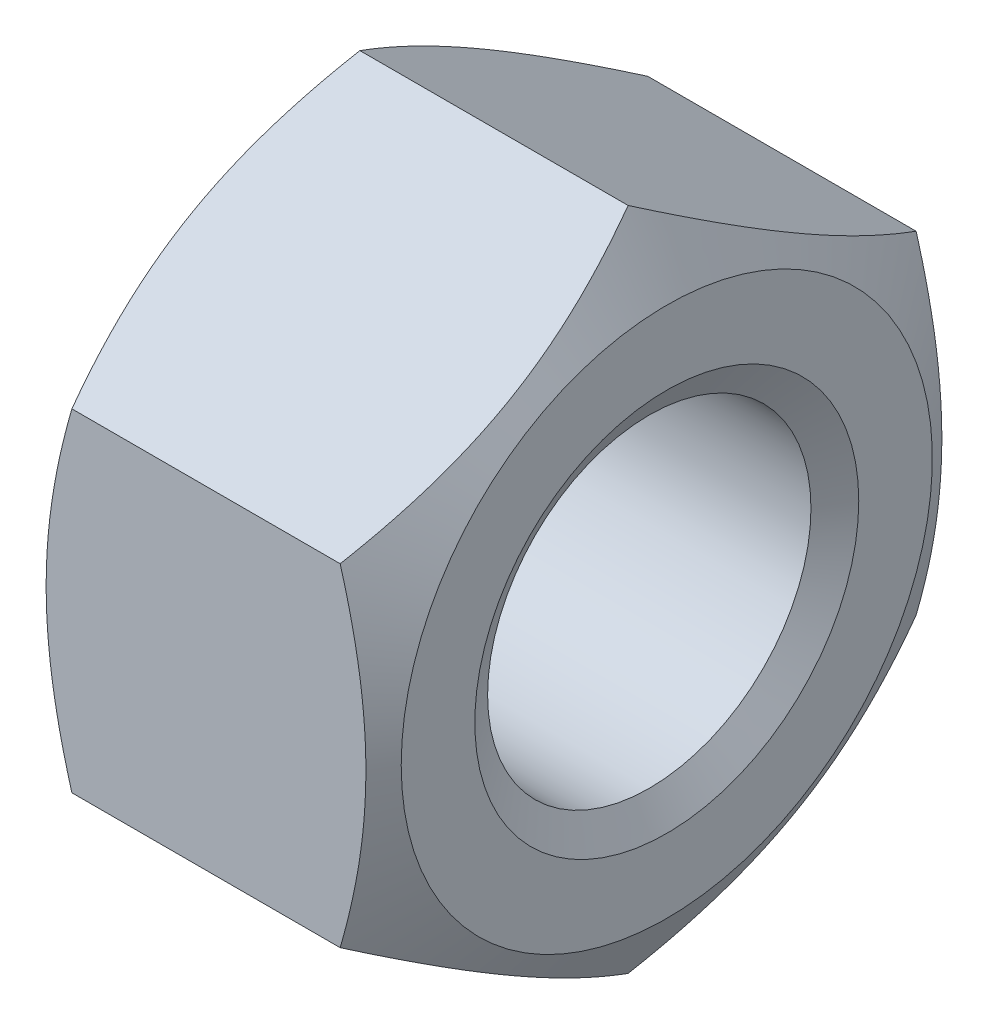
ISO-10303-21;
HEADER;
FILE_DESCRIPTION(('STEP AP214'),'2;1');
FILE_NAME('part.step','',(''),(''),'','','');
FILE_SCHEMA(('AUTOMOTIVE_DESIGN { 1 0 10303 214 1 1 1 1 }'));
ENDSEC;
DATA;
#1=APPLICATION_CONTEXT('core data for automotive mechanical design processes');
#2=APPLICATION_PROTOCOL_DEFINITION('international standard','automotive_design',2000,#1);
#3=PRODUCT_CONTEXT('',#1,'mechanical');
#4=PRODUCT('Part','Part','',(#3));
#5=PRODUCT_RELATED_PRODUCT_CATEGORY('part','',(#4));
#6=PRODUCT_DEFINITION_FORMATION('','',#4);
#7=PRODUCT_DEFINITION_CONTEXT('part definition',#1,'design');
#8=PRODUCT_DEFINITION('design','',#6,#7);
#9=PRODUCT_DEFINITION_SHAPE('','',#8);
#10=(LENGTH_UNIT() NAMED_UNIT(*) SI_UNIT(.MILLI.,.METRE.));
#11=(NAMED_UNIT(*) PLANE_ANGLE_UNIT() SI_UNIT($,.RADIAN.));
#12=(NAMED_UNIT(*) SI_UNIT($,.STERADIAN.) SOLID_ANGLE_UNIT());
#13=UNCERTAINTY_MEASURE_WITH_UNIT(LENGTH_MEASURE(1.E-05),#10,'distance_accuracy_value','');
#14=(GEOMETRIC_REPRESENTATION_CONTEXT(3) GLOBAL_UNCERTAINTY_ASSIGNED_CONTEXT((#13)) GLOBAL_UNIT_ASSIGNED_CONTEXT((#10,
#11,#12)) REPRESENTATION_CONTEXT('',''));
#15=CARTESIAN_POINT('',(0.,0.,0.));
#16=DIRECTION('',(0.,0.,1.));
#17=DIRECTION('',(1.,0.,0.));
#18=AXIS2_PLACEMENT_3D('',#15,#16,#17);
#19=CARTESIAN_POINT('',(0.,-5.19615242270663,9.));
#20=DIRECTION('',(0.,0.,1.));
#21=DIRECTION('',(1.,0.,0.));
#22=AXIS2_PLACEMENT_3D('',#19,#20,#21);
#23=PLANE('',#22);
#24=CARTESIAN_POINT('',(9.59200720064007,5.19615244908415,8.99999996280712));
#25=CARTESIAN_POINT('',(9.65793670212001,4.96774649350231,8.99999998663965));
#26=CARTESIAN_POINT('',(9.72087447602505,4.73844967700903,8.99999999641912));
#27=CARTESIAN_POINT('',(9.83994111979633,4.27799396747926,9.00000000358241));
#28=CARTESIAN_POINT('',(9.89606705063499,4.04683431625319,9.00000000096088));
#29=CARTESIAN_POINT('',(10.0007491843029,3.5822240750426,8.99999999903685));
#30=CARTESIAN_POINT('',(10.0492872997135,3.34876937968418,8.99999999974216));
#31=CARTESIAN_POINT('',(10.1377433441188,2.88027225541366,9.00000000025778));
#32=CARTESIAN_POINT('',(10.177663034133,2.64523016099952,9.00000000006827));
#33=CARTESIAN_POINT('',(10.2471978692114,2.17951731166429,8.9999999999334));
#34=CARTESIAN_POINT('',(10.2770419920113,1.94888095311432,8.99999999998215));
#35=CARTESIAN_POINT('',(10.3270801162312,1.48657638278632,9.00000000001784));
#36=CARTESIAN_POINT('',(10.3472749702591,1.25490826400092,9.00000000000477));
#37=CARTESIAN_POINT('',(10.3775101246047,0.791170290793493,8.99999999999523));
#38=CARTESIAN_POINT('',(10.3875619477008,0.55910119292837,8.99999999999872));
#39=CARTESIAN_POINT('',(10.3972935688812,0.0947495491302438,9.00000000000127));
#40=CARTESIAN_POINT('',(10.3969736875073,-0.137532989984409,9.00000000000031));
#41=CARTESIAN_POINT('',(10.3866846794573,-0.57177716286161,8.99999999999972));
#42=CARTESIAN_POINT('',(10.377970648293,-0.773769446120306,8.99999999999992));
#43=CARTESIAN_POINT('',(10.3528689081992,-1.17728085842499,9.00000000000007));
#44=CARTESIAN_POINT('',(10.33648068214,-1.37879995466515,9.00000000000002));
#45=CARTESIAN_POINT('',(10.2761920643438,-1.9825770521475,8.99999999999994));
#46=CARTESIAN_POINT('',(10.2211752626681,-2.38376637535483,8.99999999999998));
#47=CARTESIAN_POINT('',(10.0836351513658,-3.19040010074285,9.00000000000001));
#48=CARTESIAN_POINT('',(10.0005289331521,-3.59574157940424,9.00000000000001));
#49=CARTESIAN_POINT('',(9.81191325059322,-4.4003805552348,8.99999999999999));
#50=CARTESIAN_POINT('',(9.7064480744572,-4.7996883529283,8.99999999999998));
#51=CARTESIAN_POINT('',(9.59200725772001,-5.196152335705,9.));
#52=B_SPLINE_CURVE_WITH_KNOTS('',3,(#24,#25,#26,#27,#28,#29,#30,#31,#32,#33,#34,#35,#36,#37,#38,
#39,#40,#41,#42,#43,#44,#45,#46,#47,#48,#49,#50,#51),.UNSPECIFIED.,.F.,.F.,(4,2,2,2,2,2,2,2,2,2,
2,2,2,4),(0.,0.713211353556814,1.42672934244282,2.14192306043983,2.85697050292061,
3.55445831583942,4.25188448743001,4.94851746757711,5.64512891802145,6.25151818008083,
6.85794830989781,8.07167213792096,9.31231054455697,10.5505141021014),.UNSPECIFIED.);
#53=CARTESIAN_POINT('',(9.5920072451695,5.19615244446933,8.9999999623059));
#54=VERTEX_POINT('',#53);
#55=CARTESIAN_POINT('',(9.5920072451695,-5.19615237918125,8.99999999999999));
#56=VERTEX_POINT('',#55);
#57=EDGE_CURVE('E93',#54,#56,#52,.T.);
#58=ORIENTED_EDGE('',*,*,#57,.F.);
#59=DIRECTION('',(1.,0.,0.));
#60=VECTOR('',#59,1.);
#61=CARTESIAN_POINT('',(0.,5.19615242270663,8.99999999999999));
#62=LINE('',#61,#60);
#63=CARTESIAN_POINT('',(1.2079927548305,5.19615237918125,8.99999999999999));
#64=VERTEX_POINT('',#63);
#65=EDGE_CURVE('E81',#64,#54,#62,.T.);
#66=ORIENTED_EDGE('',*,*,#65,.F.);
#67=CARTESIAN_POINT('',(1.20799274207913,-5.19615233570974,9.00000000030889));
#68=CARTESIAN_POINT('',(1.14206325693761,-4.96774637828704,9.00000000011096));
#69=CARTESIAN_POINT('',(1.07912549077933,-4.73844956232118,9.00000000002974));
#70=CARTESIAN_POINT('',(0.960058854880837,-4.27799385585281,8.99999999997024));
#71=CARTESIAN_POINT('',(0.90393292416818,-4.04683420716077,8.99999999999202));
#72=CARTESIAN_POINT('',(0.799250792737941,-3.58222397040117,9.000000000008));
#73=CARTESIAN_POINT('',(0.750712679447511,-3.34876927695766,9.00000000000214));
#74=CARTESIAN_POINT('',(0.662256638697985,-2.88027215676321,8.99999999999786));
#75=CARTESIAN_POINT('',(0.622336950217984,-2.64523006451046,8.99999999999943));
#76=CARTESIAN_POINT('',(0.552802118192617,-2.17951721918733,9.00000000000055));
#77=CARTESIAN_POINT('',(0.522957996920775,-1.94888086248584,9.00000000000014));
#78=CARTESIAN_POINT('',(0.472919875623038,-1.48657629590295,8.99999999999985));
#79=CARTESIAN_POINT('',(0.452725022990142,-1.25490817901406,8.99999999999996));
#80=CARTESIAN_POINT('',(0.422489871316473,-0.791170209703929,9.00000000000004));
#81=CARTESIAN_POINT('',(0.412438049495402,-0.559101113839655,9.00000000000001));
#82=CARTESIAN_POINT('',(0.402706430692699,-0.0947494741102103,8.99999999999999));
#83=CARTESIAN_POINT('',(0.403026313168865,0.1375330629366,8.99999999999999));
#84=CARTESIAN_POINT('',(0.413315323070599,0.571777230882556,9.));
#85=CARTESIAN_POINT('',(0.42202935496873,0.773769511283963,9.));
#86=CARTESIAN_POINT('',(0.447131096290874,1.17728091785775,9.));
#87=CARTESIAN_POINT('',(0.463519322844697,1.3788000112243,9.));
#88=CARTESIAN_POINT('',(0.523807941769675,1.98257710012448,9.));
#89=CARTESIAN_POINT('',(0.5788247437223,2.38376641762009,9.));
#90=CARTESIAN_POINT('',(0.716364854652019,3.19040013112879,9.));
#91=CARTESIAN_POINT('',(0.799471072168377,3.5957416036299,9.));
#92=CARTESIAN_POINT('',(0.988086752580014,4.40038056724668,9.));
#93=CARTESIAN_POINT('',(1.09355192726445,4.79968835888711,9.));
#94=CARTESIAN_POINT('',(1.20799274227999,5.19615233570499,9.));
#95=B_SPLINE_CURVE_WITH_KNOTS('',3,(#67,#68,#69,#70,#71,#72,#73,#74,#75,#76,#77,#78,#79,#80,#81,
#82,#83,#84,#85,#86,#87,#88,#89,#90,#91,#92,#93,#94),.UNSPECIFIED.,.F.,.F.,(4,2,2,2,2,2,2,2,2,2,
2,2,2,4),(0.,0.713211345889824,1.42672932744377,2.14192303843792,2.85697047379217,
3.55445828061187,4.25188444617852,4.94851742016658,5.64512886441864,6.25151811801612,
6.85794823936689,8.07167205058294,9.3123104387298,10.5505139776479),.UNSPECIFIED.);
#96=CARTESIAN_POINT('',(1.20799277213901,-5.19615241449011,9.00000001423143));
#97=VERTEX_POINT('',#96);
#98=EDGE_CURVE('E117',#97,#64,#95,.T.);
#99=ORIENTED_EDGE('',*,*,#98,.F.);
#100=DIRECTION('',(1.,0.,0.));
#101=VECTOR('',#100,1.);
#102=CARTESIAN_POINT('',(0.,-5.19615242270664,8.99999999999999));
#103=LINE('',#102,#101);
#104=EDGE_CURVE('E96',#56,#97,#103,.F.);
#105=ORIENTED_EDGE('',*,*,#104,.F.);
#106=EDGE_LOOP('',(#58,#66,#99,#105));
#107=FACE_BOUND('',#106,.T.);
#108=ADVANCED_FACE('F17',(#107),#23,.T.);
#109=CARTESIAN_POINT('',(0.,5.19615242270663,9.));
#110=DIRECTION('',(0.,0.866025403784438,0.500000000000001));
#111=DIRECTION('',(0.,-0.500000000000001,0.866025403784438));
#112=AXIS2_PLACEMENT_3D('',#109,#110,#111);
#113=PLANE('',#112);
#114=CARTESIAN_POINT('',(9.59200725792021,10.3923048021826,7.54946286066119E-08));
#115=CARTESIAN_POINT('',(9.65793674306191,10.2781018233001,0.197805436899549));
#116=CARTESIAN_POINT('',(9.72087450922028,10.1634534152469,0.396382304492316));
#117=CARTESIAN_POINT('',(9.83994114511887,9.93322556196127,0.795148643581762));
#118=CARTESIAN_POINT('',(9.89606707583153,9.81764573763406,0.995338771689851));
#119=CARTESIAN_POINT('',(10.0007492072618,9.58534061926805,1.39770303958999));
#120=CARTESIAN_POINT('',(10.0492873205522,9.46861327254122,1.59988073474187));
#121=CARTESIAN_POINT('',(10.1377433613018,9.23436471244027,2.00561114242802));
#122=CARTESIAN_POINT('',(10.1776630497818,9.11684366631524,2.20916356527836));
#123=CARTESIAN_POINT('',(10.2471978818072,8.88398724365462,2.61248272019752));
#124=CARTESIAN_POINT('',(10.2770420030791,8.76866906530352,2.81221966413711));
#125=CARTESIAN_POINT('',(10.3270801243769,8.53751678201179,3.21258716308334));
#126=CARTESIAN_POINT('',(10.3472749770098,8.42168272356743,3.4132176375561));
#127=CARTESIAN_POINT('',(10.3775101286835,8.18981373891241,3.81482649967816));
#128=CARTESIAN_POINT('',(10.3875619505046,8.07377919098024,4.01580423212991));
#129=CARTESIAN_POINT('',(10.3972935693073,7.84160337111547,4.4179445484246));
#130=CARTESIAN_POINT('',(10.3969736868311,7.72546210259206,4.61910712636266));
#131=CARTESIAN_POINT('',(10.3866846769294,7.50834001861906,4.99517360724915));
#132=CARTESIAN_POINT('',(10.3779706450313,7.40734387841834,5.17010405344514));
#133=CARTESIAN_POINT('',(10.3528689037092,7.20558817513141,5.51955518225488));
#134=CARTESIAN_POINT('',(10.3364806771554,7.10482862844812,5.69407583645796));
#135=CARTESIAN_POINT('',(10.2761920582304,6.80294008399798,6.21696213366861));
#136=CARTESIAN_POINT('',(10.2211752562778,6.60234542525015,6.5644022743468));
#137=CARTESIAN_POINT('',(10.0836351453481,6.19902856849573,7.26296756179443));
#138=CARTESIAN_POINT('',(10.0005289278317,5.99635783224514,7.61400357418784));
#139=CARTESIAN_POINT('',(9.81191324742003,5.59403835043668,8.31084135755487));
#140=CARTESIAN_POINT('',(9.70644807273557,5.39438445461643,8.65665204904461));
#141=CARTESIAN_POINT('',(9.59200725772002,5.19615246620746,8.99999992465435));
#142=B_SPLINE_CURVE_WITH_KNOTS('',3,(#114,#115,#116,#117,#118,#119,#120,#121,#122,#123,#124,
#125,#126,#127,#128,#129,#130,#131,#132,#133,#134,#135,#136,#137,#138,#139,#140,#141),
.UNSPECIFIED.,.F.,.F.,(4,2,2,2,2,2,2,2,2,2,2,2,2,4),(0.,0.713211345889916,1.42672932744395,
2.14192303843818,2.85697047379251,3.55445828061228,4.25188444617901,4.94851742016713,
5.64512886441927,6.25151811801684,6.8579482393677,8.07167205058394,9.31231043873101,
10.5505139776494),.UNSPECIFIED.);
#143=CARTESIAN_POINT('',(9.59200722786119,10.3923048536294,1.42308400314339E-08));
#144=VERTEX_POINT('',#143);
#145=EDGE_CURVE('E21',#144,#54,#142,.T.);
#146=ORIENTED_EDGE('',*,*,#145,.F.);
#147=DIRECTION('',(1.,0.,0.));
#148=VECTOR('',#147,1.);
#149=CARTESIAN_POINT('',(0.,10.3923048454133,0.));
#150=LINE('',#149,#148);
#151=CARTESIAN_POINT('',(1.20799275483071,10.3923048236509,3.76934948367667E-08));
#152=VERTEX_POINT('',#151);
#153=EDGE_CURVE('E74',#152,#144,#150,.T.);
#154=ORIENTED_EDGE('',*,*,#153,.F.);
#155=CARTESIAN_POINT('',(1.20799279935993,5.1961523773079,9.00000000424715));
#156=CARTESIAN_POINT('',(1.14206329787999,5.31035537573839,8.80219465625389));
#157=CARTESIAN_POINT('',(1.07912552397495,5.42500379245431,8.60361779305354));
#158=CARTESIAN_POINT('',(0.960058880203668,5.65523165342278,8.20485145486482));
#159=CARTESIAN_POINT('',(0.903932949365012,5.77081147676551,8.00466132326232));
#160=CARTESIAN_POINT('',(0.799250815697067,6.00311659570455,7.60229705055352));
#161=CARTESIAN_POINT('',(0.750712700286465,6.11984394399457,7.40011935409303));
#162=CARTESIAN_POINT('',(0.662256655881174,6.35409250657636,6.99438894313262));
#163=CARTESIAN_POINT('',(0.622336965866965,6.47161355361932,6.79083651831651));
#164=CARTESIAN_POINT('',(0.552802130788645,6.70446997817013,6.38751735985593));
#165=CARTESIAN_POINT('',(0.522958007988656,6.81978815748734,6.1877804143397));
#166=CARTESIAN_POINT('',(0.47291988376879,7.05094044268224,5.78741291216785));
#167=CARTESIAN_POINT('',(0.45272502974087,7.16677450206363,5.5867824360462));
#168=CARTESIAN_POINT('',(0.422489875395268,7.39864348865907,5.18517357054429));
#169=CARTESIAN_POINT('',(0.412438052299213,7.51467803759467,4.98419583636151));
#170=CARTESIAN_POINT('',(0.402706431118774,7.74685385949593,4.58205551654454));
#171=CARTESIAN_POINT('',(0.403026312492679,7.86299512905243,4.38089293681523));
#172=CARTESIAN_POINT('',(0.413315320542661,8.08011721549054,4.00482645165786));
#173=CARTESIAN_POINT('',(0.422029351707016,8.18111335712009,3.82989600298747));
#174=CARTESIAN_POINT('',(0.447131091800781,8.38286906327262,3.48044486921466));
#175=CARTESIAN_POINT('',(0.463519317860063,8.48362861139269,3.30592421252292));
#176=CARTESIAN_POINT('',(0.523807935656274,8.78551716013387,2.7830379078798));
#177=CARTESIAN_POINT('',(0.578824737331943,8.98611182173763,2.43559776225508));
#178=CARTESIAN_POINT('',(0.716364848634367,9.38942868443177,1.73703246451961));
#179=CARTESIAN_POINT('',(0.799471066848111,9.59209942376252,1.3859964467912));
#180=CARTESIAN_POINT('',(0.988086749407062,9.99441891167789,0.689158652846648));
#181=CARTESIAN_POINT('',(1.09355192554313,10.1940728105247,0.343347956114764));
#182=CARTESIAN_POINT('',(1.20799274228037,10.3923048019131,7.5344503165368E-08));
#183=B_SPLINE_CURVE_WITH_KNOTS('',3,(#155,#156,#157,#158,#159,#160,#161,#162,#163,#164,#165,
#166,#167,#168,#169,#170,#171,#172,#173,#174,#175,#176,#177,#178,#179,#180,#181,#182),
.UNSPECIFIED.,.F.,.F.,(4,2,2,2,2,2,2,2,2,2,2,2,2,4),(0.,0.713211353556813,1.42672934244282,
2.14192306043983,2.85697050292061,3.55445831583942,4.25188448743001,4.94851746757711,
5.64512891802145,6.25151818008098,6.85794830989813,8.07167213792162,9.31231054455797,
10.5505141021027),.UNSPECIFIED.);
#184=EDGE_CURVE('E84',#64,#152,#183,.T.);
#185=ORIENTED_EDGE('',*,*,#184,.F.);
#186=ORIENTED_EDGE('',*,*,#65,.T.);
#187=EDGE_LOOP('',(#146,#154,#185,#186));
#188=FACE_BOUND('',#187,.T.);
#189=ADVANCED_FACE('F83',(#188),#113,.T.);
#190=CARTESIAN_POINT('',(0.,10.3923048454133,0.));
#191=DIRECTION('',(0.,0.866025403784439,-0.499999999999999));
#192=DIRECTION('',(0.,0.499999999999999,0.86602540378444));
#193=AXIS2_PLACEMENT_3D('',#190,#191,#192);
#194=PLANE('',#193);
#195=CARTESIAN_POINT('',(9.59200720064007,5.19615237730792,-9.00000000424715));
#196=CARTESIAN_POINT('',(9.65793670212533,5.31035537574763,-8.80219465623791));
#197=CARTESIAN_POINT('',(9.72087447603521,5.42500379247285,-8.60361779302146));
#198=CARTESIAN_POINT('',(9.83994111981502,5.65523165346007,-8.20485145480025));
#199=CARTESIAN_POINT('',(9.89606705065735,5.77081147681226,-8.00466132318137));
#200=CARTESIAN_POINT('',(10.0007491843318,6.00311659577156,-7.60229705043748));
#201=CARTESIAN_POINT('',(10.0492872997452,6.11984394407238,-7.40011935395827));
#202=CARTESIAN_POINT('',(10.1377433441542,6.35409250667591,-6.99438894296022));
#203=CARTESIAN_POINT('',(10.1776630341693,6.47161355372979,-6.79083651812518));
#204=CARTESIAN_POINT('',(10.2471978692416,6.70446997828213,-6.38751735966197));
#205=CARTESIAN_POINT('',(10.2770419920361,6.81978815758981,-6.18778041416224));
#206=CARTESIAN_POINT('',(10.3270801162466,7.05094044276553,-5.7874129120236));
#207=CARTESIAN_POINT('',(10.3472749702706,7.16677450213727,-5.58678243591867));
#208=CARTESIAN_POINT('',(10.3775101246098,7.39864348871224,-5.18517357045222));
#209=CARTESIAN_POINT('',(10.3875619477035,7.51467803763701,-4.98419583628818));
#210=CARTESIAN_POINT('',(10.3972935688812,7.74685385951683,-4.58205551650835));
#211=CARTESIAN_POINT('',(10.396973687507,7.86299512906271,-4.38089293679743));
#212=CARTESIAN_POINT('',(10.3866846793432,8.08011721789643,-4.00482644749074));
#213=CARTESIAN_POINT('',(10.3779706478776,8.18111336192984,-3.82989599465675));
#214=CARTESIAN_POINT('',(10.3528689068212,8.38286907287562,-3.48044485258177));
#215=CARTESIAN_POINT('',(10.3364806801004,8.48362862338509,-3.30592419175147));
#216=CARTESIAN_POINT('',(10.2761920598119,8.78551717927499,-2.78303787472641));
#217=CARTESIAN_POINT('',(10.2211752557986,8.98611184560397,-2.43559772091736));
#218=CARTESIAN_POINT('',(10.0836351386659,9.38942871785619,-1.73703240662682));
#219=CARTESIAN_POINT('',(10.0005289169172,9.59209946201502,-1.3859963805359));
#220=CARTESIAN_POINT('',(9.81191322651951,9.99441895941091,-0.689158570170615));
#221=CARTESIAN_POINT('',(9.70644804608439,10.1940728629108,-0.343347865379403));
#222=CARTESIAN_POINT('',(9.59200722482522,10.3923048588879,2.33387578688426E-08));
#223=B_SPLINE_CURVE_WITH_KNOTS('',3,(#195,#196,#197,#198,#199,#200,#201,#202,#203,#204,#205,
#206,#207,#208,#209,#210,#211,#212,#213,#214,#215,#216,#217,#218,#219,#220,#221,#222),
.UNSPECIFIED.,.F.,.F.,(4,2,2,2,2,2,2,2,2,2,2,2,2,4),(0.,0.713211353614427,1.42672934255815,
2.14192306062028,2.85697050316612,3.5544583160262,4.25188448755816,4.94851746763993,
5.64512891802147,6.25151819451823,6.8579483387769,8.07167219577065,9.31231063288167,
10.5505142206691),.UNSPECIFIED.);
#224=CARTESIAN_POINT('',(9.59200724516949,5.19615237918126,-9.));
#225=VERTEX_POINT('',#224);
#226=EDGE_CURVE('E95',#225,#144,#223,.T.);
#227=ORIENTED_EDGE('',*,*,#226,.F.);
#228=DIRECTION('',(-1.,0.,0.));
#229=VECTOR('',#228,1.);
#230=CARTESIAN_POINT('',(0.,5.19615242270666,-9.));
#231=LINE('',#230,#229);
#232=CARTESIAN_POINT('',(1.20799275483051,5.19615244446935,-8.9999999623059));
#233=VERTEX_POINT('',#232);
#234=EDGE_CURVE('E190',#233,#225,#231,.F.);
#235=ORIENTED_EDGE('',*,*,#234,.F.);
#236=CARTESIAN_POINT('',(1.20799279935927,10.3923048263918,4.14386850587665E-08));
#237=CARTESIAN_POINT('',(1.14206329787952,10.2781018692402,-0.197805330386987));
#238=CARTESIAN_POINT('',(1.07912552397457,10.1634534694627,-0.396382203366747));
#239=CARTESIAN_POINT('',(0.960058880203378,9.93322562090136,-0.795148548718681));
#240=CARTESIAN_POINT('',(0.903932949364723,9.81764579301805,-0.995338677699641));
#241=CARTESIAN_POINT('',(0.799250815696804,9.58534067074654,-1.39770294848438));
#242=CARTESIAN_POINT('',(0.750712700286227,9.46861332367815,-1.59988064565016));
#243=CARTESIAN_POINT('',(0.662256655880978,9.23436476198945,-2.00561105712614));
#244=CARTESIAN_POINT('',(0.622336965866786,9.11684371461827,-2.20916348175272));
#245=CARTESIAN_POINT('',(0.5528021307885,8.88398728983388,-2.61248264007839));
#246=CARTESIAN_POINT('',(0.522958007988529,8.76866911060113,-2.81221958564336));
#247=CARTESIAN_POINT('',(0.472919883768698,8.53751682546806,-3.21258708785086));
#248=CARTESIAN_POINT('',(0.452725029740794,8.42168276606405,-3.41321756395942));
#249=CARTESIAN_POINT('',(0.422489875395223,8.1898137794521,-3.81482642945174));
#250=CARTESIAN_POINT('',(0.412438052299182,8.07377923052258,-4.015804163638));
#251=CARTESIAN_POINT('',(0.40270643111877,7.84160340862574,-4.41794448345748));
#252=CARTESIAN_POINT('',(0.403026312492689,7.7254621390676,-4.61910706318582));
#253=CARTESIAN_POINT('',(0.413315320542691,7.50834005262851,-4.99517354834249));
#254=CARTESIAN_POINT('',(0.422029351707051,7.40734391099936,-5.17010399701301));
#255=CARTESIAN_POINT('',(0.447131091800818,7.20558820484719,-5.51955513078582));
#256=CARTESIAN_POINT('',(0.463519317860099,7.10482865672708,-5.69407578747743));
#257=CARTESIAN_POINT('',(0.523807935656294,6.80294010798589,-6.21696209212025));
#258=CARTESIAN_POINT('',(0.578824737331938,6.60234544638229,-6.56440223774485));
#259=CARTESIAN_POINT('',(0.71636484863429,6.19902858368838,-7.26296753548004));
#260=CARTESIAN_POINT('',(0.799471066847985,5.99635784435772,-7.61400355320828));
#261=CARTESIAN_POINT('',(0.988086749406821,5.5940383564425,-8.3108413471525));
#262=CARTESIAN_POINT('',(1.09355192554282,5.39438445759578,-8.65665204388423));
#263=CARTESIAN_POINT('',(1.20799274227999,5.19615246620748,-8.99999992465435));
#264=B_SPLINE_CURVE_WITH_KNOTS('',3,(#236,#237,#238,#239,#240,#241,#242,#243,#244,#245,#246,
#247,#248,#249,#250,#251,#252,#253,#254,#255,#256,#257,#258,#259,#260,#261,#262,#263),
.UNSPECIFIED.,.F.,.F.,(4,2,2,2,2,2,2,2,2,2,2,2,2,4),(0.,0.713211353556725,1.42672934244264,
2.14192306043958,2.85697050292028,3.55445831583901,4.25188448742953,4.94851746757656,
5.64512891802083,6.2515181800801,6.85794830989698,8.07167213791994,9.31231054455572,
10.5505141020999),.UNSPECIFIED.);
#265=EDGE_CURVE('E160',#152,#233,#264,.T.);
#266=ORIENTED_EDGE('',*,*,#265,.F.);
#267=ORIENTED_EDGE('',*,*,#153,.T.);
#268=EDGE_LOOP('',(#227,#235,#266,#267));
#269=FACE_BOUND('',#268,.T.);
#270=ADVANCED_FACE('F164',(#269),#194,.T.);
#271=CARTESIAN_POINT('',(0.,5.19615242270665,-9.));
#272=DIRECTION('',(0.,0.,-1.));
#273=DIRECTION('',(-1.,0.,0.));
#274=AXIS2_PLACEMENT_3D('',#271,#272,#273);
#275=PLANE('',#274);
#276=CARTESIAN_POINT('',(9.59200720064009,-5.19615244908411,-8.99999996280714));
#277=CARTESIAN_POINT('',(9.65793670212002,-4.96774649350227,-8.99999998663966));
#278=CARTESIAN_POINT('',(9.72087447602506,-4.73844967700899,-8.99999999641913));
#279=CARTESIAN_POINT('',(9.83994111979634,-4.27799396747923,-9.00000000358241));
#280=CARTESIAN_POINT('',(9.89606705063499,-4.04683431625315,-9.00000000096089));
#281=CARTESIAN_POINT('',(10.0007491843029,-3.58222407504256,-8.99999999903686));
#282=CARTESIAN_POINT('',(10.0492872997135,-3.34876937968414,-8.99999999974217));
#283=CARTESIAN_POINT('',(10.1377433441188,-2.88027225541363,-9.00000000025778));
#284=CARTESIAN_POINT('',(10.177663034133,-2.64523016099948,-9.00000000006827));
#285=CARTESIAN_POINT('',(10.2471978692114,-2.17951731166426,-8.9999999999334));
#286=CARTESIAN_POINT('',(10.2770419920113,-1.94888095311429,-8.99999999998216));
#287=CARTESIAN_POINT('',(10.3270801162312,-1.48657638278629,-9.00000000001784));
#288=CARTESIAN_POINT('',(10.3472749702591,-1.25490826400089,-9.00000000000478));
#289=CARTESIAN_POINT('',(10.3775101246047,-0.791170290793463,-8.99999999999523));
#290=CARTESIAN_POINT('',(10.3875619477008,-0.559101192928341,-8.99999999999873));
#291=CARTESIAN_POINT('',(10.3972935688812,-0.0947495491302167,-9.00000000000127));
#292=CARTESIAN_POINT('',(10.3969736875073,0.137532989984436,-9.00000000000032));
#293=CARTESIAN_POINT('',(10.3866846794573,0.571777162861635,-8.99999999999972));
#294=CARTESIAN_POINT('',(10.377970648293,0.773769446120329,-8.99999999999993));
#295=CARTESIAN_POINT('',(10.3528689081992,1.17728085842501,-9.00000000000008));
#296=CARTESIAN_POINT('',(10.33648068214,1.37879995466517,-9.00000000000003));
#297=CARTESIAN_POINT('',(10.2761920643438,1.98257705214751,-8.99999999999995));
#298=CARTESIAN_POINT('',(10.2211752626681,2.38376637535485,-8.99999999999999));
#299=CARTESIAN_POINT('',(10.0836351513658,3.19040010074286,-9.00000000000002));
#300=CARTESIAN_POINT('',(10.0005289331521,3.59574157940424,-9.00000000000001));
#301=CARTESIAN_POINT('',(9.81191325059321,4.4003805552348,-8.99999999999999));
#302=CARTESIAN_POINT('',(9.7064480744572,4.7996883529283,-8.99999999999999));
#303=CARTESIAN_POINT('',(9.59200725772001,5.19615233570499,-9.));
#304=B_SPLINE_CURVE_WITH_KNOTS('',3,(#276,#277,#278,#279,#280,#281,#282,#283,#284,#285,#286,
#287,#288,#289,#290,#291,#292,#293,#294,#295,#296,#297,#298,#299,#300,#301,#302,#303),
.UNSPECIFIED.,.F.,.F.,(4,2,2,2,2,2,2,2,2,2,2,2,2,4),(0.,0.713211353556812,1.42672934244281,
2.14192306043983,2.8569705029206,3.55445831583941,4.25188448743,4.9485174675771,
5.64512891802144,6.2515181800808,6.85794830989778,8.07167213792093,9.31231054455693,
10.5505141021013),.UNSPECIFIED.);
#305=CARTESIAN_POINT('',(9.59200724516949,-5.1961524444693,-8.99999996230594));
#306=VERTEX_POINT('',#305);
#307=EDGE_CURVE('E175',#306,#225,#304,.T.);
#308=ORIENTED_EDGE('',*,*,#307,.F.);
#309=DIRECTION('',(1.,0.,0.));
#310=VECTOR('',#309,1.);
#311=CARTESIAN_POINT('',(0.,-5.1961524227066,-9.00000000000003));
#312=LINE('',#311,#310);
#313=CARTESIAN_POINT('',(1.2079927548305,-5.19615237918121,-9.00000000000002));
#314=VERTEX_POINT('',#313);
#315=EDGE_CURVE('E188',#314,#306,#312,.T.);
#316=ORIENTED_EDGE('',*,*,#315,.F.);
#317=CARTESIAN_POINT('',(1.20799279935994,5.19615244908417,-8.99999996280712));
#318=CARTESIAN_POINT('',(1.14206329788,4.96774649350233,-8.99999998663965));
#319=CARTESIAN_POINT('',(1.07912552397496,4.73844967700905,-8.99999999641913));
#320=CARTESIAN_POINT('',(0.960058880203678,4.27799396747928,-9.00000000358241));
#321=CARTESIAN_POINT('',(0.903932949365021,4.04683431625321,-9.00000000096089));
#322=CARTESIAN_POINT('',(0.799250815697075,3.58222407504261,-8.99999999903686));
#323=CARTESIAN_POINT('',(0.750712700286472,3.3487693796842,-8.99999999974217));
#324=CARTESIAN_POINT('',(0.66225665588118,2.88027225541368,-9.00000000025778));
#325=CARTESIAN_POINT('',(0.622336965866971,2.64523016099953,-9.00000000006827));
#326=CARTESIAN_POINT('',(0.552802130788649,2.17951731166431,-8.9999999999334));
#327=CARTESIAN_POINT('',(0.522958007988659,1.94888095311434,-8.99999999998216));
#328=CARTESIAN_POINT('',(0.472919883768793,1.48657638278634,-9.00000000001784));
#329=CARTESIAN_POINT('',(0.452725029740872,1.25490826400093,-9.00000000000478));
#330=CARTESIAN_POINT('',(0.422489875395269,0.791170290793507,-8.99999999999523));
#331=CARTESIAN_POINT('',(0.412438052299214,0.559101192928384,-8.99999999999873));
#332=CARTESIAN_POINT('',(0.402706431118774,0.0947495491302577,-9.00000000000127));
#333=CARTESIAN_POINT('',(0.403026312492678,-0.137532989984396,-9.00000000000032));
#334=CARTESIAN_POINT('',(0.413315320542658,-0.571777162861596,-8.99999999999972));
#335=CARTESIAN_POINT('',(0.42202935170701,-0.77376944612029,-8.99999999999993));
#336=CARTESIAN_POINT('',(0.447131091800763,-1.17728085842497,-9.00000000000008));
#337=CARTESIAN_POINT('',(0.463519317860037,-1.37879995466513,-9.00000000000003));
#338=CARTESIAN_POINT('',(0.523807935656217,-1.98257705214747,-8.99999999999995));
#339=CARTESIAN_POINT('',(0.578824737331858,-2.38376637535481,-8.99999999999999));
#340=CARTESIAN_POINT('',(0.716364848634213,-3.19040010074282,-9.00000000000002));
#341=CARTESIAN_POINT('',(0.799471066847916,-3.5957415794042,-9.00000000000001));
#342=CARTESIAN_POINT('',(0.988086749406775,-4.40038055523476,-8.99999999999999));
#343=CARTESIAN_POINT('',(1.09355192554279,-4.79968835292826,-8.99999999999999));
#344=CARTESIAN_POINT('',(1.20799274227998,-5.19615233570495,-9.));
#345=B_SPLINE_CURVE_WITH_KNOTS('',3,(#317,#318,#319,#320,#321,#322,#323,#324,#325,#326,#327,
#328,#329,#330,#331,#332,#333,#334,#335,#336,#337,#338,#339,#340,#341,#342,#343,#344),
.UNSPECIFIED.,.F.,.F.,(4,2,2,2,2,2,2,2,2,2,2,2,2,4),(0.,0.713211353556815,1.42672934244282,
2.14192306043984,2.85697050292062,3.55445831583943,4.25188448743002,4.94851746757712,
5.64512891802146,6.25151818008083,6.85794830989781,8.07167213792096,9.31231054455695,
10.5505141021014),.UNSPECIFIED.);
#346=EDGE_CURVE('E155',#233,#314,#345,.T.);
#347=ORIENTED_EDGE('',*,*,#346,.F.);
#348=ORIENTED_EDGE('',*,*,#234,.T.);
#349=EDGE_LOOP('',(#308,#316,#347,#348));
#350=FACE_BOUND('',#349,.T.);
#351=ADVANCED_FACE('F167',(#350),#275,.T.);
#352=CARTESIAN_POINT('',(0.,-5.19615242270661,-9.00000000000002));
#353=DIRECTION('',(0.,-0.866025403784438,-0.500000000000001));
#354=DIRECTION('',(0.,0.500000000000001,-0.866025403784438));
#355=AXIS2_PLACEMENT_3D('',#352,#353,#354);
#356=PLANE('',#355);
#357=CARTESIAN_POINT('',(9.59200720064007,-10.392304826392,4.14400340477495E-08));
#358=CARTESIAN_POINT('',(9.65793670212001,-10.2781018692407,-0.197805330385759));
#359=CARTESIAN_POINT('',(9.72087447602505,-10.1634534694633,-0.396382203365581));
#360=CARTESIAN_POINT('',(9.83994111979633,-9.93322562090204,-0.795148548717587));
#361=CARTESIAN_POINT('',(9.89606705063499,-9.81764579301869,-0.995338677698556));
#362=CARTESIAN_POINT('',(10.0007491843029,-9.58534067074714,-1.39770294848333));
#363=CARTESIAN_POINT('',(10.0492872997135,-9.46861332367874,-1.59988064564913));
#364=CARTESIAN_POINT('',(10.1377433441188,-9.23436476199002,-2.00561105712516));
#365=CARTESIAN_POINT('',(10.177663034133,-9.11684371461883,-2.20916348175176));
#366=CARTESIAN_POINT('',(10.2471978692114,-8.88398728983441,-2.61248264007746));
#367=CARTESIAN_POINT('',(10.2770419920113,-8.76866911060165,-2.81221958564245));
#368=CARTESIAN_POINT('',(10.3270801162312,-8.53751682546855,-3.21258708784999));
#369=CARTESIAN_POINT('',(10.3472749702591,-8.42168276606454,-3.41321756395857));
#370=CARTESIAN_POINT('',(10.3775101246047,-8.18981377945256,-3.81482642945093));
#371=CARTESIAN_POINT('',(10.3875619477008,-8.07377923052302,-4.01580416363721));
#372=CARTESIAN_POINT('',(10.3972935688812,-7.84160340862617,-4.41794448345673));
#373=CARTESIAN_POINT('',(10.3969736875073,-7.72546213906801,-4.61910706318509));
#374=CARTESIAN_POINT('',(10.3866846794573,-7.50834005262889,-4.99517354834181));
#375=CARTESIAN_POINT('',(10.377970648293,-7.40734391099972,-5.17010399701236));
#376=CARTESIAN_POINT('',(10.3528689081992,-7.20558820484751,-5.51955513078523));
#377=CARTESIAN_POINT('',(10.33648068214,-7.10482865672739,-5.69407578747687));
#378=CARTESIAN_POINT('',(10.2761920643438,-6.80294010798614,-6.21696209211978));
#379=CARTESIAN_POINT('',(10.2211752626681,-6.6023454463825,-6.56440223774444));
#380=CARTESIAN_POINT('',(10.0836351513658,-6.19902858368852,-7.26296753547976));
#381=CARTESIAN_POINT('',(10.0005289331521,-5.99635784435782,-7.61400355320807));
#382=CARTESIAN_POINT('',(9.81191325059321,-5.59403835644252,-8.31084134715242));
#383=CARTESIAN_POINT('',(9.7064480744572,-5.39438445759577,-8.65665204388421));
#384=CARTESIAN_POINT('',(9.59200725772,-5.19615246620743,-8.99999992465439));
#385=B_SPLINE_CURVE_WITH_KNOTS('',3,(#357,#358,#359,#360,#361,#362,#363,#364,#365,#366,#367,
#368,#369,#370,#371,#372,#373,#374,#375,#376,#377,#378,#379,#380,#381,#382,#383,#384),
.UNSPECIFIED.,.F.,.F.,(4,2,2,2,2,2,2,2,2,2,2,2,2,4),(0.,0.713211353556815,1.42672934244282,
2.14192306043983,2.85697050292062,3.55445831583943,4.25188448743001,4.94851746757711,
5.64512891802146,6.25151818008083,6.85794830989781,8.07167213792098,9.31231054455699,
10.5505141021014),.UNSPECIFIED.);
#386=CARTESIAN_POINT('',(9.5920072451695,-10.3923048236506,3.76940938703726E-08));
#387=VERTEX_POINT('',#386);
#388=EDGE_CURVE('E99',#387,#306,#385,.T.);
#389=ORIENTED_EDGE('',*,*,#388,.F.);
#390=DIRECTION('',(1.,0.,0.));
#391=VECTOR('',#390,1.);
#392=CARTESIAN_POINT('',(0.,-10.3923048454133,0.));
#393=LINE('',#392,#391);
#394=CARTESIAN_POINT('',(1.2079927548305,-10.3923048236506,-3.76940952316399E-08));
#395=VERTEX_POINT('',#394);
#396=EDGE_CURVE('E192',#395,#387,#393,.T.);
#397=ORIENTED_EDGE('',*,*,#396,.F.);
#398=CARTESIAN_POINT('',(1.20799279935994,-5.19615237730787,-9.00000000424719));
#399=CARTESIAN_POINT('',(1.14206329788,-5.31035537573836,-8.80219465625392));
#400=CARTESIAN_POINT('',(1.07912552397496,-5.42500379245428,-8.60361779305358));
#401=CARTESIAN_POINT('',(0.960058880203677,-5.65523165342275,-8.20485145486485));
#402=CARTESIAN_POINT('',(0.90393294936502,-5.77081147676548,-8.00466132326236));
#403=CARTESIAN_POINT('',(0.799250815697074,-6.00311659570452,-7.60229705055356));
#404=CARTESIAN_POINT('',(0.750712700286471,-6.11984394399454,-7.40011935409307));
#405=CARTESIAN_POINT('',(0.662256655881178,-6.35409250657634,-6.99438894313265));
#406=CARTESIAN_POINT('',(0.622336965866968,-6.47161355361929,-6.79083651831654));
#407=CARTESIAN_POINT('',(0.552802130788646,-6.70446997817011,-6.38751735985597));
#408=CARTESIAN_POINT('',(0.522958007988657,-6.81978815748731,-6.18778041433974));
#409=CARTESIAN_POINT('',(0.472919883768791,-7.05094044268222,-5.78741291216788));
#410=CARTESIAN_POINT('',(0.45272502974087,-7.16677450206361,-5.58678243604624));
#411=CARTESIAN_POINT('',(0.422489875395267,-7.39864348865905,-5.18517357054432));
#412=CARTESIAN_POINT('',(0.412438052299212,-7.51467803759464,-4.98419583636154));
#413=CARTESIAN_POINT('',(0.402706431118771,-7.74685385949591,-4.58205551654457));
#414=CARTESIAN_POINT('',(0.403026312492675,-7.86299512905241,-4.38089293681525));
#415=CARTESIAN_POINT('',(0.413315320542655,-8.0801172154905,-4.00482645165794));
#416=CARTESIAN_POINT('',(0.422029351707006,-8.18111335712002,-3.82989600298759));
#417=CARTESIAN_POINT('',(0.44713109180076,-8.38286906327249,-3.48044486921487));
#418=CARTESIAN_POINT('',(0.463519317860034,-8.48362861139253,-3.30592421252318));
#419=CARTESIAN_POINT('',(0.523807935656217,-8.78551716013363,-2.7830379078802));
#420=CARTESIAN_POINT('',(0.578824737331858,-8.98611182173734,-2.43559776225558));
#421=CARTESIAN_POINT('',(0.716364848634214,-9.38942868443137,-1.73703246452029));
#422=CARTESIAN_POINT('',(0.799471066847918,-9.59209942376206,-1.38599644679198));
#423=CARTESIAN_POINT('',(0.98808674940678,-9.99441891167733,-0.689158652847609));
#424=CARTESIAN_POINT('',(1.0935519255428,-10.1940728105241,-0.343347956115816));
#425=CARTESIAN_POINT('',(1.20799274227999,-10.3923048019124,-7.53456454771554E-08));
#426=B_SPLINE_CURVE_WITH_KNOTS('',3,(#398,#399,#400,#401,#402,#403,#404,#405,#406,#407,#408,
#409,#410,#411,#412,#413,#414,#415,#416,#417,#418,#419,#420,#421,#422,#423,#424,#425),
.UNSPECIFIED.,.F.,.F.,(4,2,2,2,2,2,2,2,2,2,2,2,2,4),(0.,0.713211353556814,1.42672934244282,
2.14192306043983,2.85697050292062,3.55445831583943,4.25188448743001,4.94851746757712,
5.64512891802146,6.25151818008083,6.85794830989781,8.07167213792098,9.31231054455698,
10.5505141021014),.UNSPECIFIED.);
#427=EDGE_CURVE('E41',#314,#395,#426,.T.);
#428=ORIENTED_EDGE('',*,*,#427,.F.);
#429=ORIENTED_EDGE('',*,*,#315,.T.);
#430=EDGE_LOOP('',(#389,#397,#428,#429));
#431=FACE_BOUND('',#430,.T.);
#432=ADVANCED_FACE('F171',(#431),#356,.T.);
#433=CARTESIAN_POINT('',(0.,-10.3923048454133,0.));
#434=DIRECTION('',(0.,-0.866025403784439,0.5));
#435=DIRECTION('',(0.,-0.5,-0.866025403784439));
#436=AXIS2_PLACEMENT_3D('',#433,#434,#435);
#437=PLANE('',#436);
#438=CARTESIAN_POINT('',(9.59200720064008,-5.19615237730791,9.00000000424715));
#439=CARTESIAN_POINT('',(9.65793670212001,-5.3103553757384,8.80219465625388));
#440=CARTESIAN_POINT('',(9.72087447602505,-5.42500379245431,8.60361779305354));
#441=CARTESIAN_POINT('',(9.83994111979633,-5.65523165342278,8.20485145486482));
#442=CARTESIAN_POINT('',(9.89606705063499,-5.77081147676551,8.00466132326232));
#443=CARTESIAN_POINT('',(10.0007491843029,-6.00311659570455,7.60229705055352));
#444=CARTESIAN_POINT('',(10.0492872997135,-6.11984394399457,7.40011935409303));
#445=CARTESIAN_POINT('',(10.1377433441188,-6.35409250657637,6.99438894313261));
#446=CARTESIAN_POINT('',(10.177663034133,-6.47161355361932,6.79083651831651));
#447=CARTESIAN_POINT('',(10.2471978692114,-6.70446997817013,6.38751735985593));
#448=CARTESIAN_POINT('',(10.2770419920113,-6.81978815748734,6.1877804143397));
#449=CARTESIAN_POINT('',(10.3270801162312,-7.05094044268224,5.78741291216785));
#450=CARTESIAN_POINT('',(10.3472749702591,-7.16677450206363,5.5867824360462));
#451=CARTESIAN_POINT('',(10.3775101246047,-7.39864348865907,5.18517357054429));
#452=CARTESIAN_POINT('',(10.3875619477008,-7.51467803759467,4.98419583636151));
#453=CARTESIAN_POINT('',(10.3972935688812,-7.74685385949593,4.58205551654454));
#454=CARTESIAN_POINT('',(10.3969736875073,-7.86299512905243,4.38089293681522));
#455=CARTESIAN_POINT('',(10.3866846794573,-8.08011721549052,4.00482645165791));
#456=CARTESIAN_POINT('',(10.377970648293,-8.18111335712004,3.82989600298756));
#457=CARTESIAN_POINT('',(10.3528689081992,-8.38286906327251,3.48044486921484));
#458=CARTESIAN_POINT('',(10.33648068214,-8.48362861139255,3.30592421252316));
#459=CARTESIAN_POINT('',(10.2761920643438,-8.78551716013365,2.78303790788017));
#460=CARTESIAN_POINT('',(10.2211752626681,-8.98611182173735,2.43559776225555));
#461=CARTESIAN_POINT('',(10.0836351513658,-9.38942868443139,1.73703246452027));
#462=CARTESIAN_POINT('',(10.0005289331521,-9.59209942376207,1.38599644679196));
#463=CARTESIAN_POINT('',(9.81191325059322,-9.99441891167734,0.689158652847595));
#464=CARTESIAN_POINT('',(9.7064480744572,-10.1940728105241,0.343347956115804));
#465=CARTESIAN_POINT('',(9.59200725772001,-10.3923048019124,7.53456362425749E-08));
#466=B_SPLINE_CURVE_WITH_KNOTS('',3,(#438,#439,#440,#441,#442,#443,#444,#445,#446,#447,#448,
#449,#450,#451,#452,#453,#454,#455,#456,#457,#458,#459,#460,#461,#462,#463,#464,#465),
.UNSPECIFIED.,.F.,.F.,(4,2,2,2,2,2,2,2,2,2,2,2,2,4),(0.,0.713211353556814,1.42672934244282,
2.14192306043983,2.85697050292061,3.55445831583942,4.25188448743,4.94851746757711,
5.64512891802145,6.25151818008082,6.8579483098978,8.07167213792095,9.31231054455695,
10.5505141021014),.UNSPECIFIED.);
#467=EDGE_CURVE('E98',#56,#387,#466,.T.);
#468=ORIENTED_EDGE('',*,*,#467,.F.);
#469=ORIENTED_EDGE('',*,*,#104,.T.);
#470=CARTESIAN_POINT('',(1.20799279935993,-10.392304826392,-4.1440037384949E-08));
#471=CARTESIAN_POINT('',(1.14206329787467,-10.2781018692315,0.197805330401733));
#472=CARTESIAN_POINT('',(1.07912552396479,-10.1634534694448,0.396382203397661));
#473=CARTESIAN_POINT('',(0.960058880184981,-9.93322562086476,0.795148548782154));
#474=CARTESIAN_POINT('',(0.903932949342646,-9.81764579297195,0.995338677779506));
#475=CARTESIAN_POINT('',(0.799250815668191,-9.58534067068014,1.39770294859937));
#476=CARTESIAN_POINT('',(0.750712700254839,-9.46861332360094,1.59988064578388));
#477=CARTESIAN_POINT('',(0.662256655845838,-9.23436476189049,2.00561105729756));
#478=CARTESIAN_POINT('',(0.622336965830669,-9.11684371450837,2.20916348194308));
#479=CARTESIAN_POINT('',(0.552802130758434,-8.88398728972243,2.61248264027142));
#480=CARTESIAN_POINT('',(0.52295800796387,-8.7686691104992,2.81221958581991));
#481=CARTESIAN_POINT('',(0.472919883753369,-8.53751682538528,3.21258708799423));
#482=CARTESIAN_POINT('',(0.45272502972939,-8.42168276599091,3.41321756408609));
#483=CARTESIAN_POINT('',(0.422489875390212,-8.18981377939941,3.814826429543));
#484=CARTESIAN_POINT('',(0.412438052296544,-8.0737792304807,4.01580416371054));
#485=CARTESIAN_POINT('',(0.402706431118792,-7.84160340860528,4.41794448349291));
#486=CARTESIAN_POINT('',(0.403026312493035,-7.72546213905775,4.61910706320288));
#487=CARTESIAN_POINT('',(0.413315320656783,-7.50834005022297,4.99517355250901));
#488=CARTESIAN_POINT('',(0.422029352122377,-7.40734390618988,5.17010400534326));
#489=CARTESIAN_POINT('',(0.447131093178829,-7.20558819524431,5.51955514741848));
#490=CARTESIAN_POINT('',(0.463519319899626,-7.10482864473472,5.69407580824878));
#491=CARTESIAN_POINT('',(0.5238079401881,-6.8029400888446,6.21696212527391));
#492=CARTESIAN_POINT('',(0.578824744201432,-6.60234542251563,6.56440227908309));
#493=CARTESIAN_POINT('',(0.716364861334265,-6.19902855026336,7.26296759337386));
#494=CARTESIAN_POINT('',(0.799471083083024,-5.99635780610445,7.61400361946486));
#495=CARTESIAN_POINT('',(0.988086773480766,-5.59403830870842,8.31084142983032));
#496=CARTESIAN_POINT('',(1.09355195391593,-5.39438440520851,8.65665213462162));
#497=CARTESIAN_POINT('',(1.20799277517517,-5.19615240923134,9.00000002333989));
#498=B_SPLINE_CURVE_WITH_KNOTS('',3,(#470,#471,#472,#473,#474,#475,#476,#477,#478,#479,#480,
#481,#482,#483,#484,#485,#486,#487,#488,#489,#490,#491,#492,#493,#494,#495,#496,#497),
.UNSPECIFIED.,.F.,.F.,(4,2,2,2,2,2,2,2,2,2,2,2,2,4),(0.,0.713211353614428,1.42672934255815,
2.14192306062029,2.85697050316613,3.5544583160262,4.25188448755816,4.94851746763992,
5.64512891802147,6.2515181945184,6.85794833877724,8.07167219577132,9.31231063288269,
10.5505142206704),.UNSPECIFIED.);
#499=EDGE_CURVE('E143',#395,#97,#498,.T.);
#500=ORIENTED_EDGE('',*,*,#499,.F.);
#501=ORIENTED_EDGE('',*,*,#396,.T.);
#502=EDGE_LOOP('',(#468,#469,#500,#501));
#503=FACE_BOUND('',#502,.T.);
#504=ADVANCED_FACE('F211',(#503),#437,.T.);
#505=CARTESIAN_POINT('',(9.5847592764127,0.,0.));
#506=DIRECTION('',(-1.,0.,0.));
#507=DIRECTION('',(0.,0.,1.));
#508=AXIS2_PLACEMENT_3D('',#505,#506,#507);
#509=CONICAL_SURFACE('',#508,10.4048586737543,1.04719755);
#510=CARTESIAN_POINT('',(10.8000000012518,0.,0.));
#511=DIRECTION('',(-1.,0.,0.));
#512=DIRECTION('',(0.,0.,1.));
#513=AXIS2_PLACEMENT_3D('',#510,#511,#512);
#514=CIRCLE('',#513,8.30000000072274);
#515=CARTESIAN_POINT('',(10.8000000012518,0.,8.30000000072274));
#516=VERTEX_POINT('',#515);
#517=EDGE_CURVE('E205',#516,#516,#514,.F.);
#518=ORIENTED_EDGE('',*,*,#517,.F.);
#519=EDGE_LOOP('',(#518));
#520=FACE_BOUND('',#519,.T.);
#521=ORIENTED_EDGE('',*,*,#307,.T.);
#522=ORIENTED_EDGE('',*,*,#226,.T.);
#523=ORIENTED_EDGE('',*,*,#145,.T.);
#524=ORIENTED_EDGE('',*,*,#57,.T.);
#525=ORIENTED_EDGE('',*,*,#467,.T.);
#526=ORIENTED_EDGE('',*,*,#388,.T.);
#527=EDGE_LOOP('',(#521,#522,#523,#524,#525,#526));
#528=FACE_BOUND('',#527,.T.);
#529=ADVANCED_FACE('F91',(#520,#528),#509,.T.);
#530=CARTESIAN_POINT('',(1.21524072358731,0.,0.));
#531=DIRECTION('',(1.,0.,0.));
#532=DIRECTION('',(0.,0.,-1.));
#533=AXIS2_PLACEMENT_3D('',#530,#531,#532);
#534=CONICAL_SURFACE('',#533,10.4048586737543,1.04719755);
#535=CARTESIAN_POINT('',(-1.25182351463915E-09,0.,0.));
#536=DIRECTION('',(1.,0.,0.));
#537=DIRECTION('',(0.,0.,-1.));
#538=AXIS2_PLACEMENT_3D('',#535,#536,#537);
#539=CIRCLE('',#538,8.30000000072274);
#540=CARTESIAN_POINT('',(-1.25182351463915E-09,0.,-8.30000000072274));
#541=VERTEX_POINT('',#540);
#542=EDGE_CURVE('E203',#541,#541,#539,.T.);
#543=ORIENTED_EDGE('',*,*,#542,.T.);
#544=EDGE_LOOP('',(#543));
#545=FACE_BOUND('',#544,.T.);
#546=ORIENTED_EDGE('',*,*,#427,.T.);
#547=ORIENTED_EDGE('',*,*,#499,.T.);
#548=ORIENTED_EDGE('',*,*,#98,.T.);
#549=ORIENTED_EDGE('',*,*,#184,.T.);
#550=ORIENTED_EDGE('',*,*,#265,.T.);
#551=ORIENTED_EDGE('',*,*,#346,.T.);
#552=EDGE_LOOP('',(#546,#547,#548,#549,#550,#551));
#553=FACE_BOUND('',#552,.T.);
#554=ADVANCED_FACE('F131',(#545,#553),#534,.T.);
#555=CARTESIAN_POINT('',(10.8,0.,0.));
#556=DIRECTION('',(1.,0.,0.));
#557=DIRECTION('',(0.,0.,-1.));
#558=AXIS2_PLACEMENT_3D('',#555,#556,#557);
#559=PLANE('',#558);
#560=CARTESIAN_POINT('',(10.8000000005859,0.,0.));
#561=DIRECTION('',(1.,0.,0.));
#562=DIRECTION('',(0.,0.,-1.));
#563=AXIS2_PLACEMENT_3D('',#560,#561,#562);
#564=CIRCLE('',#563,6.00021528509842);
#565=CARTESIAN_POINT('',(10.8000000005859,0.,-6.00021528509842));
#566=VERTEX_POINT('',#565);
#567=EDGE_CURVE('E200',#566,#566,#564,.F.);
#568=ORIENTED_EDGE('',*,*,#567,.T.);
#569=EDGE_LOOP('',(#568));
#570=FACE_BOUND('',#569,.T.);
#571=ORIENTED_EDGE('',*,*,#517,.T.);
#572=EDGE_LOOP('',(#571));
#573=FACE_BOUND('',#572,.T.);
#574=ADVANCED_FACE('F135',(#570,#573),#559,.T.);
#575=CARTESIAN_POINT('',(0.,0.,0.));
#576=DIRECTION('',(1.,0.,0.));
#577=DIRECTION('',(0.,0.,-1.));
#578=AXIS2_PLACEMENT_3D('',#575,#576,#577);
#579=PLANE('',#578);
#580=CARTESIAN_POINT('',(-5.11590769747272E-10,0.,0.));
#581=DIRECTION('',(-1.,0.,0.));
#582=DIRECTION('',(0.,0.,1.));
#583=AXIS2_PLACEMENT_3D('',#580,#581,#582);
#584=CIRCLE('',#583,6.00021528509842);
#585=CARTESIAN_POINT('',(-5.11590769747272E-10,0.,6.00021528509842));
#586=VERTEX_POINT('',#585);
#587=EDGE_CURVE('E197',#586,#586,#584,.F.);
#588=ORIENTED_EDGE('',*,*,#587,.T.);
#589=EDGE_LOOP('',(#588));
#590=FACE_BOUND('',#589,.T.);
#591=ORIENTED_EDGE('',*,*,#542,.F.);
#592=EDGE_LOOP('',(#591));
#593=FACE_BOUND('',#592,.T.);
#594=ADVANCED_FACE('F237',(#590,#593),#579,.F.);
#595=CARTESIAN_POINT('',(10.8000000005859,0.,0.));
#596=DIRECTION('',(1.,0.,0.));
#597=DIRECTION('',(0.,0.,-1.));
#598=AXIS2_PLACEMENT_3D('',#595,#596,#597);
#599=CONICAL_SURFACE('',#598,6.00021528509842,1.04719754997565);
#600=ORIENTED_EDGE('',*,*,#567,.F.);
#601=EDGE_LOOP('',(#600));
#602=FACE_BOUND('',#601,.T.);
#603=CARTESIAN_POINT('',(10.253125,0.,0.));
#604=DIRECTION('',(-1.,0.,0.));
#605=DIRECTION('',(0.,-1.,0.));
#606=AXIS2_PLACEMENT_3D('',#603,#604,#605);
#607=CIRCLE('',#606,5.053);
#608=CARTESIAN_POINT('',(10.253125,-5.053,0.));
#609=VERTEX_POINT('',#608);
#610=EDGE_CURVE('E32',#609,#609,#607,.T.);
#611=ORIENTED_EDGE('',*,*,#610,.T.);
#612=EDGE_LOOP('',(#611));
#613=FACE_BOUND('',#612,.T.);
#614=ADVANCED_FACE('F221',(#602,#613),#599,.F.);
#615=CARTESIAN_POINT('',(-5.11590769747272E-10,0.,0.));
#616=DIRECTION('',(-1.,0.,0.));
#617=DIRECTION('',(0.,0.,1.));
#618=AXIS2_PLACEMENT_3D('',#615,#616,#617);
#619=CONICAL_SURFACE('',#618,6.00021528509842,1.04719754999467);
#620=ORIENTED_EDGE('',*,*,#587,.F.);
#621=EDGE_LOOP('',(#620));
#622=FACE_BOUND('',#621,.T.);
#623=CARTESIAN_POINT('',(0.546875,0.,0.));
#624=DIRECTION('',(1.,0.,0.));
#625=DIRECTION('',(0.,0.,-1.));
#626=AXIS2_PLACEMENT_3D('',#623,#624,#625);
#627=CIRCLE('',#626,5.053);
#628=CARTESIAN_POINT('',(0.546875,0.,-5.053));
#629=VERTEX_POINT('',#628);
#630=EDGE_CURVE('E11',#629,#629,#627,.T.);
#631=ORIENTED_EDGE('',*,*,#630,.T.);
#632=EDGE_LOOP('',(#631));
#633=FACE_BOUND('',#632,.T.);
#634=ADVANCED_FACE('F224',(#622,#633),#619,.F.);
#635=CARTESIAN_POINT('',(10.253125,0.,0.));
#636=DIRECTION('',(-1.,0.,0.));
#637=DIRECTION('',(0.,-1.,0.));
#638=AXIS2_PLACEMENT_3D('',#635,#636,#637);
#639=CYLINDRICAL_SURFACE('',#638,5.053);
#640=ORIENTED_EDGE('',*,*,#630,.F.);
#641=EDGE_LOOP('',(#640));
#642=FACE_BOUND('',#641,.T.);
#643=ORIENTED_EDGE('',*,*,#610,.F.);
#644=EDGE_LOOP('',(#643));
#645=FACE_BOUND('',#644,.T.);
#646=ADVANCED_FACE('F19',(#642,#645),#639,.F.);
#647=CLOSED_SHELL('',(#108,#189,#270,#351,#432,#504,#529,#554,#574,#594,#614,#634,#646));
#648=MANIFOLD_SOLID_BREP('B1',#647);
#649=ADVANCED_BREP_SHAPE_REPRESENTATION('',(#18,#648),#14);
#650=SHAPE_DEFINITION_REPRESENTATION(#9,#649);
ENDSEC;
END-ISO-10303-21;
